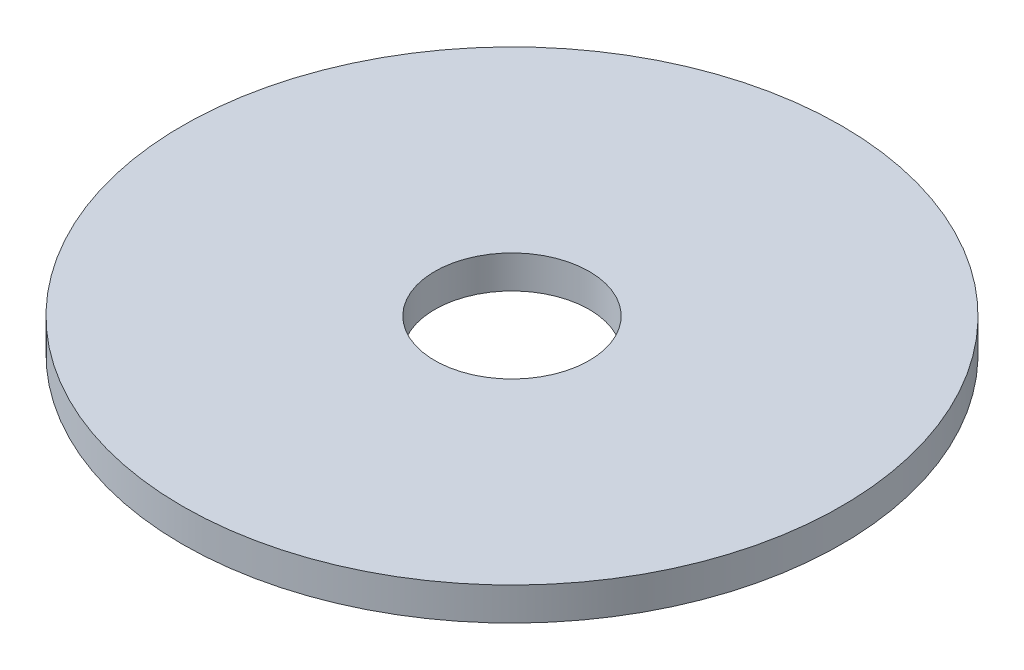
ISO-10303-21;
HEADER;
FILE_DESCRIPTION(('STEP AP214'),'2;1');
FILE_NAME('part.step','',(''),(''),'','','');
FILE_SCHEMA(('AUTOMOTIVE_DESIGN { 1 0 10303 214 1 1 1 1 }'));
ENDSEC;
DATA;
#1=APPLICATION_CONTEXT('core data for automotive mechanical design processes');
#2=APPLICATION_PROTOCOL_DEFINITION('international standard','automotive_design',2000,#1);
#3=PRODUCT_CONTEXT('',#1,'mechanical');
#4=PRODUCT('Part','Part','',(#3));
#5=PRODUCT_RELATED_PRODUCT_CATEGORY('part','',(#4));
#6=PRODUCT_DEFINITION_FORMATION('','',#4);
#7=PRODUCT_DEFINITION_CONTEXT('part definition',#1,'design');
#8=PRODUCT_DEFINITION('design','',#6,#7);
#9=PRODUCT_DEFINITION_SHAPE('','',#8);
#10=(LENGTH_UNIT() NAMED_UNIT(*) SI_UNIT(.MILLI.,.METRE.));
#11=(NAMED_UNIT(*) PLANE_ANGLE_UNIT() SI_UNIT($,.RADIAN.));
#12=(NAMED_UNIT(*) SI_UNIT($,.STERADIAN.) SOLID_ANGLE_UNIT());
#13=UNCERTAINTY_MEASURE_WITH_UNIT(LENGTH_MEASURE(1.E-05),#10,'distance_accuracy_value','');
#14=(GEOMETRIC_REPRESENTATION_CONTEXT(3) GLOBAL_UNCERTAINTY_ASSIGNED_CONTEXT((#13)) GLOBAL_UNIT_ASSIGNED_CONTEXT((#10,
#11,#12)) REPRESENTATION_CONTEXT('',''));
#15=CARTESIAN_POINT('',(0.,0.,0.));
#16=DIRECTION('',(0.,0.,1.));
#17=DIRECTION('',(1.,0.,0.));
#18=AXIS2_PLACEMENT_3D('',#15,#16,#17);
#19=CARTESIAN_POINT('',(0.,0.,0.));
#20=DIRECTION('',(0.,-1.,0.));
#21=DIRECTION('',(0.,0.,-1.));
#22=AXIS2_PLACEMENT_3D('',#19,#20,#21);
#23=CYLINDRICAL_SURFACE('',#22,16.);
#24=CARTESIAN_POINT('',(0.,0.,0.));
#25=DIRECTION('',(0.,-1.,0.));
#26=DIRECTION('',(0.,0.,-1.));
#27=AXIS2_PLACEMENT_3D('',#24,#25,#26);
#28=CIRCLE('',#27,16.);
#29=CARTESIAN_POINT('',(0.,0.,-16.));
#30=VERTEX_POINT('',#29);
#31=EDGE_CURVE('E27',#30,#30,#28,.T.);
#32=ORIENTED_EDGE('',*,*,#31,.F.);
#33=EDGE_LOOP('',(#32));
#34=FACE_BOUND('',#33,.T.);
#35=CARTESIAN_POINT('',(0.,1.6,0.));
#36=DIRECTION('',(0.,-1.,0.));
#37=DIRECTION('',(0.,0.,-1.));
#38=AXIS2_PLACEMENT_3D('',#35,#36,#37);
#39=CIRCLE('',#38,16.);
#40=CARTESIAN_POINT('',(0.,1.6,-16.));
#41=VERTEX_POINT('',#40);
#42=EDGE_CURVE('E18',#41,#41,#39,.F.);
#43=ORIENTED_EDGE('',*,*,#42,.F.);
#44=EDGE_LOOP('',(#43));
#45=FACE_BOUND('',#44,.T.);
#46=ADVANCED_FACE('F15',(#34,#45),#23,.T.);
#47=CARTESIAN_POINT('',(0.,1.6,0.));
#48=DIRECTION('',(0.,1.,0.));
#49=DIRECTION('',(0.,0.,1.));
#50=AXIS2_PLACEMENT_3D('',#47,#48,#49);
#51=PLANE('',#50);
#52=CARTESIAN_POINT('',(0.,1.6,0.));
#53=DIRECTION('',(0.,-1.,0.));
#54=DIRECTION('',(0.,0.,-1.));
#55=AXIS2_PLACEMENT_3D('',#52,#53,#54);
#56=CIRCLE('',#55,3.75);
#57=CARTESIAN_POINT('',(0.,1.6,-3.75));
#58=VERTEX_POINT('',#57);
#59=EDGE_CURVE('E22',#58,#58,#56,.F.);
#60=ORIENTED_EDGE('',*,*,#59,.F.);
#61=EDGE_LOOP('',(#60));
#62=FACE_BOUND('',#61,.T.);
#63=ORIENTED_EDGE('',*,*,#42,.T.);
#64=EDGE_LOOP('',(#63));
#65=FACE_BOUND('',#64,.T.);
#66=ADVANCED_FACE('F35',(#62,#65),#51,.T.);
#67=CARTESIAN_POINT('',(0.,0.,0.));
#68=DIRECTION('',(0.,1.,0.));
#69=DIRECTION('',(0.,0.,1.));
#70=AXIS2_PLACEMENT_3D('',#67,#68,#69);
#71=PLANE('',#70);
#72=CARTESIAN_POINT('',(0.,0.,0.));
#73=DIRECTION('',(0.,-1.,0.));
#74=DIRECTION('',(0.,0.,-1.));
#75=AXIS2_PLACEMENT_3D('',#72,#73,#74);
#76=CIRCLE('',#75,3.75);
#77=CARTESIAN_POINT('',(0.,0.,-3.75));
#78=VERTEX_POINT('',#77);
#79=EDGE_CURVE('E10',#78,#78,#76,.T.);
#80=ORIENTED_EDGE('',*,*,#79,.F.);
#81=EDGE_LOOP('',(#80));
#82=FACE_BOUND('',#81,.T.);
#83=ORIENTED_EDGE('',*,*,#31,.T.);
#84=EDGE_LOOP('',(#83));
#85=FACE_BOUND('',#84,.T.);
#86=ADVANCED_FACE('F43',(#82,#85),#71,.F.);
#87=CARTESIAN_POINT('',(0.,1.6,0.));
#88=DIRECTION('',(0.,-1.,0.));
#89=DIRECTION('',(0.,0.,-1.));
#90=AXIS2_PLACEMENT_3D('',#87,#88,#89);
#91=CYLINDRICAL_SURFACE('',#90,3.75);
#92=ORIENTED_EDGE('',*,*,#59,.T.);
#93=EDGE_LOOP('',(#92));
#94=FACE_BOUND('',#93,.T.);
#95=ORIENTED_EDGE('',*,*,#79,.T.);
#96=EDGE_LOOP('',(#95));
#97=FACE_BOUND('',#96,.T.);
#98=ADVANCED_FACE('F45',(#94,#97),#91,.F.);
#99=CLOSED_SHELL('',(#46,#66,#86,#98));
#100=MANIFOLD_SOLID_BREP('B1',#99);
#101=ADVANCED_BREP_SHAPE_REPRESENTATION('',(#18,#100),#14);
#102=SHAPE_DEFINITION_REPRESENTATION(#9,#101);
ENDSEC;
END-ISO-10303-21;
